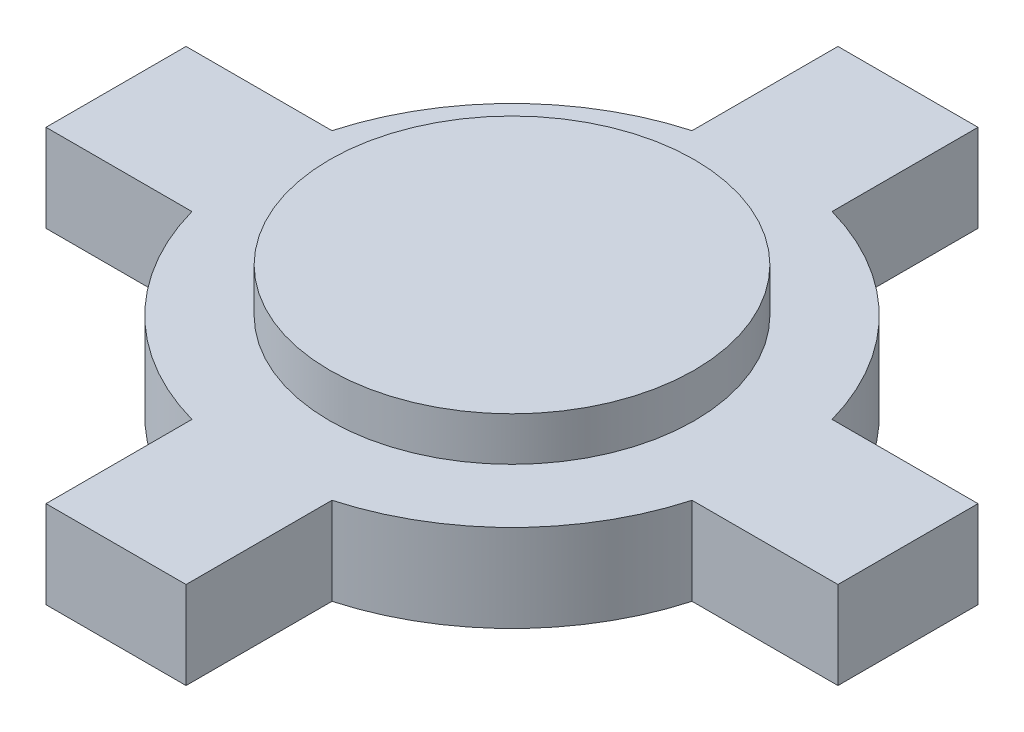
ISO-10303-21;
HEADER;
FILE_DESCRIPTION(('STEP AP214'),'2;1');
FILE_NAME('part.step','',(''),(''),'','','');
FILE_SCHEMA(('AUTOMOTIVE_DESIGN { 1 0 10303 214 1 1 1 1 }'));
ENDSEC;
DATA;
#1=APPLICATION_CONTEXT('core data for automotive mechanical design processes');
#2=APPLICATION_PROTOCOL_DEFINITION('international standard','automotive_design',2000,#1);
#3=PRODUCT_CONTEXT('',#1,'mechanical');
#4=PRODUCT('Part','Part','',(#3));
#5=PRODUCT_RELATED_PRODUCT_CATEGORY('part','',(#4));
#6=PRODUCT_DEFINITION_FORMATION('','',#4);
#7=PRODUCT_DEFINITION_CONTEXT('part definition',#1,'design');
#8=PRODUCT_DEFINITION('design','',#6,#7);
#9=PRODUCT_DEFINITION_SHAPE('','',#8);
#10=(LENGTH_UNIT() NAMED_UNIT(*) SI_UNIT(.MILLI.,.METRE.));
#11=(NAMED_UNIT(*) PLANE_ANGLE_UNIT() SI_UNIT($,.RADIAN.));
#12=(NAMED_UNIT(*) SI_UNIT($,.STERADIAN.) SOLID_ANGLE_UNIT());
#13=UNCERTAINTY_MEASURE_WITH_UNIT(LENGTH_MEASURE(1.E-05),#10,'distance_accuracy_value','');
#14=(GEOMETRIC_REPRESENTATION_CONTEXT(3) GLOBAL_UNCERTAINTY_ASSIGNED_CONTEXT((#13)) GLOBAL_UNIT_ASSIGNED_CONTEXT((#10,
#11,#12)) REPRESENTATION_CONTEXT('',''));
#15=CARTESIAN_POINT('',(0.,0.,0.));
#16=DIRECTION('',(0.,0.,1.));
#17=DIRECTION('',(1.,0.,0.));
#18=AXIS2_PLACEMENT_3D('',#15,#16,#17);
#19=CARTESIAN_POINT('',(-13.5702975444263,3.,-2.4));
#20=DIRECTION('',(1.,0.,0.));
#21=DIRECTION('',(0.,0.,-1.));
#22=AXIS2_PLACEMENT_3D('',#19,#20,#21);
#23=PLANE('',#22);
#24=DIRECTION('',(0.,0.,1.));
#25=VECTOR('',#24,1.);
#26=CARTESIAN_POINT('',(-13.5702975444263,0.,-2.4));
#27=LINE('',#26,#25);
#28=CARTESIAN_POINT('',(-13.5702975444263,0.,-2.4));
#29=VERTEX_POINT('',#28);
#30=CARTESIAN_POINT('',(-13.5702975444263,0.,2.4));
#31=VERTEX_POINT('',#30);
#32=EDGE_CURVE('E187',#29,#31,#27,.T.);
#33=ORIENTED_EDGE('',*,*,#32,.T.);
#34=DIRECTION('',(0.,-1.,0.));
#35=VECTOR('',#34,1.);
#36=CARTESIAN_POINT('',(-13.5702975444263,3.,2.4));
#37=LINE('',#36,#35);
#38=CARTESIAN_POINT('',(-13.5702975444263,3.,2.4));
#39=VERTEX_POINT('',#38);
#40=EDGE_CURVE('E44',#39,#31,#37,.T.);
#41=ORIENTED_EDGE('',*,*,#40,.F.);
#42=DIRECTION('',(0.,0.,1.));
#43=VECTOR('',#42,1.);
#44=CARTESIAN_POINT('',(-13.5702975444263,3.,-2.4));
#45=LINE('',#44,#43);
#46=CARTESIAN_POINT('',(-13.5702975444263,3.,-2.4));
#47=VERTEX_POINT('',#46);
#48=EDGE_CURVE('E218',#47,#39,#45,.T.);
#49=ORIENTED_EDGE('',*,*,#48,.F.);
#50=DIRECTION('',(0.,-1.,0.));
#51=VECTOR('',#50,1.);
#52=CARTESIAN_POINT('',(-13.5702975444263,3.,-2.4));
#53=LINE('',#52,#51);
#54=EDGE_CURVE('E183',#47,#29,#53,.T.);
#55=ORIENTED_EDGE('',*,*,#54,.T.);
#56=EDGE_LOOP('',(#33,#41,#49,#55));
#57=FACE_BOUND('',#56,.T.);
#58=ADVANCED_FACE('F41',(#57),#23,.F.);
#59=CARTESIAN_POINT('',(-13.5702975444263,3.,2.4));
#60=DIRECTION('',(0.,0.,-1.));
#61=DIRECTION('',(-1.,0.,0.));
#62=AXIS2_PLACEMENT_3D('',#59,#60,#61);
#63=PLANE('',#62);
#64=DIRECTION('',(1.,0.,0.));
#65=VECTOR('',#64,1.);
#66=CARTESIAN_POINT('',(-13.5702975444263,0.,2.4));
#67=LINE('',#66,#65);
#68=CARTESIAN_POINT('',(-8.57029754442633,0.,2.4));
#69=VERTEX_POINT('',#68);
#70=EDGE_CURVE('E190',#31,#69,#67,.T.);
#71=ORIENTED_EDGE('',*,*,#70,.T.);
#72=DIRECTION('',(0.,-1.,0.));
#73=VECTOR('',#72,1.);
#74=CARTESIAN_POINT('',(-8.57029754442633,3.,2.4));
#75=LINE('',#74,#73);
#76=CARTESIAN_POINT('',(-8.57029754442633,3.,2.4));
#77=VERTEX_POINT('',#76);
#78=EDGE_CURVE('E251',#77,#69,#75,.T.);
#79=ORIENTED_EDGE('',*,*,#78,.F.);
#80=DIRECTION('',(1.,0.,0.));
#81=VECTOR('',#80,1.);
#82=CARTESIAN_POINT('',(-13.5702975444263,3.,2.4));
#83=LINE('',#82,#81);
#84=EDGE_CURVE('E126',#39,#77,#83,.T.);
#85=ORIENTED_EDGE('',*,*,#84,.F.);
#86=ORIENTED_EDGE('',*,*,#40,.T.);
#87=EDGE_LOOP('',(#71,#79,#85,#86));
#88=FACE_BOUND('',#87,.T.);
#89=ADVANCED_FACE('F257',(#88),#63,.F.);
#90=CARTESIAN_POINT('',(0.,3.,0.));
#91=DIRECTION('',(0.,-1.,0.));
#92=DIRECTION('',(0.,0.,-1.));
#93=AXIS2_PLACEMENT_3D('',#90,#91,#92);
#94=CYLINDRICAL_SURFACE('',#93,8.9);
#95=CARTESIAN_POINT('',(0.,0.,0.));
#96=DIRECTION('',(0.,1.,0.));
#97=DIRECTION('',(0.,0.,1.));
#98=AXIS2_PLACEMENT_3D('',#95,#96,#97);
#99=CIRCLE('',#98,8.9);
#100=CARTESIAN_POINT('',(-2.39999999999999,0.,8.57029754442633));
#101=VERTEX_POINT('',#100);
#102=EDGE_CURVE('E193',#69,#101,#99,.T.);
#103=ORIENTED_EDGE('',*,*,#102,.T.);
#104=DIRECTION('',(0.,-1.,0.));
#105=VECTOR('',#104,1.);
#106=CARTESIAN_POINT('',(-2.39999999999999,3.,8.57029754442633));
#107=LINE('',#106,#105);
#108=CARTESIAN_POINT('',(-2.39999999999999,3.,8.57029754442633));
#109=VERTEX_POINT('',#108);
#110=EDGE_CURVE('E249',#109,#101,#107,.T.);
#111=ORIENTED_EDGE('',*,*,#110,.F.);
#112=CARTESIAN_POINT('',(0.,3.,0.));
#113=DIRECTION('',(0.,1.,0.));
#114=DIRECTION('',(0.,0.,1.));
#115=AXIS2_PLACEMENT_3D('',#112,#113,#114);
#116=CIRCLE('',#115,8.9);
#117=EDGE_CURVE('E274',#77,#109,#116,.T.);
#118=ORIENTED_EDGE('',*,*,#117,.F.);
#119=ORIENTED_EDGE('',*,*,#78,.T.);
#120=EDGE_LOOP('',(#103,#111,#118,#119));
#121=FACE_BOUND('',#120,.T.);
#122=ADVANCED_FACE('F266',(#121),#94,.T.);
#123=CARTESIAN_POINT('',(-2.39999999999999,3.,8.57029754442633));
#124=DIRECTION('',(1.,0.,0.));
#125=DIRECTION('',(0.,0.,-1.));
#126=AXIS2_PLACEMENT_3D('',#123,#124,#125);
#127=PLANE('',#126);
#128=DIRECTION('',(0.,0.,1.));
#129=VECTOR('',#128,1.);
#130=CARTESIAN_POINT('',(-2.39999999999999,0.,8.57029754442633));
#131=LINE('',#130,#129);
#132=CARTESIAN_POINT('',(-2.4,0.,13.5702975444263));
#133=VERTEX_POINT('',#132);
#134=EDGE_CURVE('E195',#101,#133,#131,.T.);
#135=ORIENTED_EDGE('',*,*,#134,.T.);
#136=DIRECTION('',(0.,-1.,0.));
#137=VECTOR('',#136,1.);
#138=CARTESIAN_POINT('',(-2.4,3.,13.5702975444263));
#139=LINE('',#138,#137);
#140=CARTESIAN_POINT('',(-2.4,3.,13.5702975444263));
#141=VERTEX_POINT('',#140);
#142=EDGE_CURVE('E246',#141,#133,#139,.T.);
#143=ORIENTED_EDGE('',*,*,#142,.F.);
#144=DIRECTION('',(0.,0.,1.));
#145=VECTOR('',#144,1.);
#146=CARTESIAN_POINT('',(-2.39999999999999,3.,8.57029754442633));
#147=LINE('',#146,#145);
#148=EDGE_CURVE('E271',#109,#141,#147,.T.);
#149=ORIENTED_EDGE('',*,*,#148,.F.);
#150=ORIENTED_EDGE('',*,*,#110,.T.);
#151=EDGE_LOOP('',(#135,#143,#149,#150));
#152=FACE_BOUND('',#151,.T.);
#153=ADVANCED_FACE('F269',(#152),#127,.F.);
#154=CARTESIAN_POINT('',(-2.4,3.,13.5702975444263));
#155=DIRECTION('',(0.,0.,-1.));
#156=DIRECTION('',(-1.,0.,0.));
#157=AXIS2_PLACEMENT_3D('',#154,#155,#156);
#158=PLANE('',#157);
#159=DIRECTION('',(1.,0.,0.));
#160=VECTOR('',#159,1.);
#161=CARTESIAN_POINT('',(-2.4,0.,13.5702975444263));
#162=LINE('',#161,#160);
#163=CARTESIAN_POINT('',(2.4,0.,13.5702975444263));
#164=VERTEX_POINT('',#163);
#165=EDGE_CURVE('E197',#133,#164,#162,.T.);
#166=ORIENTED_EDGE('',*,*,#165,.T.);
#167=DIRECTION('',(0.,-1.,0.));
#168=VECTOR('',#167,1.);
#169=CARTESIAN_POINT('',(2.4,3.,13.5702975444263));
#170=LINE('',#169,#168);
#171=CARTESIAN_POINT('',(2.4,3.,13.5702975444263));
#172=VERTEX_POINT('',#171);
#173=EDGE_CURVE('E243',#172,#164,#170,.T.);
#174=ORIENTED_EDGE('',*,*,#173,.F.);
#175=DIRECTION('',(1.,0.,0.));
#176=VECTOR('',#175,1.);
#177=CARTESIAN_POINT('',(-2.4,3.,13.5702975444263));
#178=LINE('',#177,#176);
#179=EDGE_CURVE('E273',#141,#172,#178,.T.);
#180=ORIENTED_EDGE('',*,*,#179,.F.);
#181=ORIENTED_EDGE('',*,*,#142,.T.);
#182=EDGE_LOOP('',(#166,#174,#180,#181));
#183=FACE_BOUND('',#182,.T.);
#184=ADVANCED_FACE('F333',(#183),#158,.F.);
#185=CARTESIAN_POINT('',(2.39999999999999,3.,8.57029754442633));
#186=DIRECTION('',(-1.,0.,0.));
#187=DIRECTION('',(0.,0.,1.));
#188=AXIS2_PLACEMENT_3D('',#185,#186,#187);
#189=PLANE('',#188);
#190=DIRECTION('',(0.,0.,-1.));
#191=VECTOR('',#190,1.);
#192=CARTESIAN_POINT('',(2.39999999999999,0.,8.57029754442633));
#193=LINE('',#192,#191);
#194=CARTESIAN_POINT('',(2.39999999999999,0.,8.57029754442633));
#195=VERTEX_POINT('',#194);
#196=EDGE_CURVE('E199',#164,#195,#193,.T.);
#197=ORIENTED_EDGE('',*,*,#196,.T.);
#198=DIRECTION('',(0.,-1.,0.));
#199=VECTOR('',#198,1.);
#200=CARTESIAN_POINT('',(2.39999999999999,3.,8.57029754442633));
#201=LINE('',#200,#199);
#202=CARTESIAN_POINT('',(2.39999999999999,3.,8.57029754442633));
#203=VERTEX_POINT('',#202);
#204=EDGE_CURVE('E240',#203,#195,#201,.T.);
#205=ORIENTED_EDGE('',*,*,#204,.F.);
#206=DIRECTION('',(0.,0.,-1.));
#207=VECTOR('',#206,1.);
#208=CARTESIAN_POINT('',(2.39999999999999,3.,8.57029754442633));
#209=LINE('',#208,#207);
#210=EDGE_CURVE('E276',#172,#203,#209,.T.);
#211=ORIENTED_EDGE('',*,*,#210,.F.);
#212=ORIENTED_EDGE('',*,*,#173,.T.);
#213=EDGE_LOOP('',(#197,#205,#211,#212));
#214=FACE_BOUND('',#213,.T.);
#215=ADVANCED_FACE('F330',(#214),#189,.F.);
#216=CARTESIAN_POINT('',(0.,3.,0.));
#217=DIRECTION('',(0.,-1.,0.));
#218=DIRECTION('',(0.,0.,-1.));
#219=AXIS2_PLACEMENT_3D('',#216,#217,#218);
#220=CYLINDRICAL_SURFACE('',#219,8.9);
#221=CARTESIAN_POINT('',(0.,0.,0.));
#222=DIRECTION('',(0.,1.,0.));
#223=DIRECTION('',(0.,0.,1.));
#224=AXIS2_PLACEMENT_3D('',#221,#222,#223);
#225=CIRCLE('',#224,8.9);
#226=CARTESIAN_POINT('',(8.57029754442633,0.,2.4));
#227=VERTEX_POINT('',#226);
#228=EDGE_CURVE('E201',#195,#227,#225,.T.);
#229=ORIENTED_EDGE('',*,*,#228,.T.);
#230=DIRECTION('',(0.,-1.,0.));
#231=VECTOR('',#230,1.);
#232=CARTESIAN_POINT('',(8.57029754442633,3.,2.4));
#233=LINE('',#232,#231);
#234=CARTESIAN_POINT('',(8.57029754442633,3.,2.4));
#235=VERTEX_POINT('',#234);
#236=EDGE_CURVE('E237',#235,#227,#233,.T.);
#237=ORIENTED_EDGE('',*,*,#236,.F.);
#238=CARTESIAN_POINT('',(0.,3.,0.));
#239=DIRECTION('',(0.,1.,0.));
#240=DIRECTION('',(0.,0.,1.));
#241=AXIS2_PLACEMENT_3D('',#238,#239,#240);
#242=CIRCLE('',#241,8.9);
#243=EDGE_CURVE('E282',#203,#235,#242,.T.);
#244=ORIENTED_EDGE('',*,*,#243,.F.);
#245=ORIENTED_EDGE('',*,*,#204,.T.);
#246=EDGE_LOOP('',(#229,#237,#244,#245));
#247=FACE_BOUND('',#246,.T.);
#248=ADVANCED_FACE('F326',(#247),#220,.T.);
#249=CARTESIAN_POINT('',(8.57029754442633,3.,2.4));
#250=DIRECTION('',(0.,0.,-1.));
#251=DIRECTION('',(-1.,0.,0.));
#252=AXIS2_PLACEMENT_3D('',#249,#250,#251);
#253=PLANE('',#252);
#254=DIRECTION('',(1.,0.,0.));
#255=VECTOR('',#254,1.);
#256=CARTESIAN_POINT('',(8.57029754442633,0.,2.4));
#257=LINE('',#256,#255);
#258=CARTESIAN_POINT('',(13.5702975444263,0.,2.4));
#259=VERTEX_POINT('',#258);
#260=EDGE_CURVE('E203',#227,#259,#257,.T.);
#261=ORIENTED_EDGE('',*,*,#260,.T.);
#262=DIRECTION('',(0.,-1.,0.));
#263=VECTOR('',#262,1.);
#264=CARTESIAN_POINT('',(13.5702975444263,3.,2.4));
#265=LINE('',#264,#263);
#266=CARTESIAN_POINT('',(13.5702975444263,3.,2.4));
#267=VERTEX_POINT('',#266);
#268=EDGE_CURVE('E234',#267,#259,#265,.T.);
#269=ORIENTED_EDGE('',*,*,#268,.F.);
#270=DIRECTION('',(1.,0.,0.));
#271=VECTOR('',#270,1.);
#272=CARTESIAN_POINT('',(8.57029754442633,3.,2.4));
#273=LINE('',#272,#271);
#274=EDGE_CURVE('E284',#235,#267,#273,.T.);
#275=ORIENTED_EDGE('',*,*,#274,.F.);
#276=ORIENTED_EDGE('',*,*,#236,.T.);
#277=EDGE_LOOP('',(#261,#269,#275,#276));
#278=FACE_BOUND('',#277,.T.);
#279=ADVANCED_FACE('F321',(#278),#253,.F.);
#280=CARTESIAN_POINT('',(13.5702975444263,3.,-2.4));
#281=DIRECTION('',(-1.,0.,0.));
#282=DIRECTION('',(0.,0.,1.));
#283=AXIS2_PLACEMENT_3D('',#280,#281,#282);
#284=PLANE('',#283);
#285=DIRECTION('',(0.,0.,-1.));
#286=VECTOR('',#285,1.);
#287=CARTESIAN_POINT('',(13.5702975444263,0.,-2.4));
#288=LINE('',#287,#286);
#289=CARTESIAN_POINT('',(13.5702975444263,0.,-2.4));
#290=VERTEX_POINT('',#289);
#291=EDGE_CURVE('E205',#259,#290,#288,.T.);
#292=ORIENTED_EDGE('',*,*,#291,.T.);
#293=DIRECTION('',(0.,-1.,0.));
#294=VECTOR('',#293,1.);
#295=CARTESIAN_POINT('',(13.5702975444263,3.,-2.4));
#296=LINE('',#295,#294);
#297=CARTESIAN_POINT('',(13.5702975444263,3.,-2.4));
#298=VERTEX_POINT('',#297);
#299=EDGE_CURVE('E231',#298,#290,#296,.T.);
#300=ORIENTED_EDGE('',*,*,#299,.F.);
#301=DIRECTION('',(0.,0.,-1.));
#302=VECTOR('',#301,1.);
#303=CARTESIAN_POINT('',(13.5702975444263,3.,-2.4));
#304=LINE('',#303,#302);
#305=EDGE_CURVE('E286',#267,#298,#304,.T.);
#306=ORIENTED_EDGE('',*,*,#305,.F.);
#307=ORIENTED_EDGE('',*,*,#268,.T.);
#308=EDGE_LOOP('',(#292,#300,#306,#307));
#309=FACE_BOUND('',#308,.T.);
#310=ADVANCED_FACE('F315',(#309),#284,.F.);
#311=CARTESIAN_POINT('',(8.57029754442633,3.,-2.4));
#312=DIRECTION('',(0.,0.,1.));
#313=DIRECTION('',(1.,0.,0.));
#314=AXIS2_PLACEMENT_3D('',#311,#312,#313);
#315=PLANE('',#314);
#316=DIRECTION('',(-1.,0.,0.));
#317=VECTOR('',#316,1.);
#318=CARTESIAN_POINT('',(8.57029754442633,0.,-2.4));
#319=LINE('',#318,#317);
#320=CARTESIAN_POINT('',(8.57029754442633,0.,-2.4));
#321=VERTEX_POINT('',#320);
#322=EDGE_CURVE('E207',#290,#321,#319,.T.);
#323=ORIENTED_EDGE('',*,*,#322,.T.);
#324=DIRECTION('',(0.,-1.,0.));
#325=VECTOR('',#324,1.);
#326=CARTESIAN_POINT('',(8.57029754442633,3.,-2.4));
#327=LINE('',#326,#325);
#328=CARTESIAN_POINT('',(8.57029754442633,3.,-2.4));
#329=VERTEX_POINT('',#328);
#330=EDGE_CURVE('E228',#329,#321,#327,.T.);
#331=ORIENTED_EDGE('',*,*,#330,.F.);
#332=DIRECTION('',(-1.,0.,0.));
#333=VECTOR('',#332,1.);
#334=CARTESIAN_POINT('',(8.57029754442633,3.,-2.4));
#335=LINE('',#334,#333);
#336=EDGE_CURVE('E288',#298,#329,#335,.T.);
#337=ORIENTED_EDGE('',*,*,#336,.F.);
#338=ORIENTED_EDGE('',*,*,#299,.T.);
#339=EDGE_LOOP('',(#323,#331,#337,#338));
#340=FACE_BOUND('',#339,.T.);
#341=ADVANCED_FACE('F311',(#340),#315,.F.);
#342=CARTESIAN_POINT('',(0.,3.,0.));
#343=DIRECTION('',(0.,-1.,0.));
#344=DIRECTION('',(0.,0.,-1.));
#345=AXIS2_PLACEMENT_3D('',#342,#343,#344);
#346=CYLINDRICAL_SURFACE('',#345,8.9);
#347=CARTESIAN_POINT('',(0.,0.,0.));
#348=DIRECTION('',(0.,1.,0.));
#349=DIRECTION('',(0.,0.,1.));
#350=AXIS2_PLACEMENT_3D('',#347,#348,#349);
#351=CIRCLE('',#350,8.9);
#352=CARTESIAN_POINT('',(2.4,0.,-8.57029754442633));
#353=VERTEX_POINT('',#352);
#354=EDGE_CURVE('E209',#321,#353,#351,.T.);
#355=ORIENTED_EDGE('',*,*,#354,.T.);
#356=DIRECTION('',(0.,-1.,0.));
#357=VECTOR('',#356,1.);
#358=CARTESIAN_POINT('',(2.4,3.,-8.57029754442633));
#359=LINE('',#358,#357);
#360=CARTESIAN_POINT('',(2.4,3.,-8.57029754442633));
#361=VERTEX_POINT('',#360);
#362=EDGE_CURVE('E225',#361,#353,#359,.T.);
#363=ORIENTED_EDGE('',*,*,#362,.F.);
#364=CARTESIAN_POINT('',(0.,3.,0.));
#365=DIRECTION('',(0.,1.,0.));
#366=DIRECTION('',(0.,0.,1.));
#367=AXIS2_PLACEMENT_3D('',#364,#365,#366);
#368=CIRCLE('',#367,8.9);
#369=EDGE_CURVE('E290',#329,#361,#368,.T.);
#370=ORIENTED_EDGE('',*,*,#369,.F.);
#371=ORIENTED_EDGE('',*,*,#330,.T.);
#372=EDGE_LOOP('',(#355,#363,#370,#371));
#373=FACE_BOUND('',#372,.T.);
#374=ADVANCED_FACE('F307',(#373),#346,.T.);
#375=CARTESIAN_POINT('',(2.4,3.,-13.5702975444263));
#376=DIRECTION('',(-1.,0.,0.));
#377=DIRECTION('',(0.,0.,1.));
#378=AXIS2_PLACEMENT_3D('',#375,#376,#377);
#379=PLANE('',#378);
#380=DIRECTION('',(0.,0.,-1.));
#381=VECTOR('',#380,1.);
#382=CARTESIAN_POINT('',(2.4,0.,-13.5702975444263));
#383=LINE('',#382,#381);
#384=CARTESIAN_POINT('',(2.4,0.,-13.5702975444263));
#385=VERTEX_POINT('',#384);
#386=EDGE_CURVE('E211',#353,#385,#383,.T.);
#387=ORIENTED_EDGE('',*,*,#386,.T.);
#388=DIRECTION('',(0.,-1.,0.));
#389=VECTOR('',#388,1.);
#390=CARTESIAN_POINT('',(2.4,3.,-13.5702975444263));
#391=LINE('',#390,#389);
#392=CARTESIAN_POINT('',(2.4,3.,-13.5702975444263));
#393=VERTEX_POINT('',#392);
#394=EDGE_CURVE('E222',#393,#385,#391,.T.);
#395=ORIENTED_EDGE('',*,*,#394,.F.);
#396=DIRECTION('',(0.,0.,-1.));
#397=VECTOR('',#396,1.);
#398=CARTESIAN_POINT('',(2.4,3.,-13.5702975444263));
#399=LINE('',#398,#397);
#400=EDGE_CURVE('E292',#361,#393,#399,.T.);
#401=ORIENTED_EDGE('',*,*,#400,.F.);
#402=ORIENTED_EDGE('',*,*,#362,.T.);
#403=EDGE_LOOP('',(#387,#395,#401,#402));
#404=FACE_BOUND('',#403,.T.);
#405=ADVANCED_FACE('F298',(#404),#379,.F.);
#406=CARTESIAN_POINT('',(-2.4,3.,-13.5702975444263));
#407=DIRECTION('',(0.,0.,1.));
#408=DIRECTION('',(1.,0.,0.));
#409=AXIS2_PLACEMENT_3D('',#406,#407,#408);
#410=PLANE('',#409);
#411=DIRECTION('',(-1.,0.,0.));
#412=VECTOR('',#411,1.);
#413=CARTESIAN_POINT('',(-2.4,0.,-13.5702975444263));
#414=LINE('',#413,#412);
#415=CARTESIAN_POINT('',(-2.4,0.,-13.5702975444263));
#416=VERTEX_POINT('',#415);
#417=EDGE_CURVE('E213',#385,#416,#414,.T.);
#418=ORIENTED_EDGE('',*,*,#417,.T.);
#419=DIRECTION('',(0.,-1.,0.));
#420=VECTOR('',#419,1.);
#421=CARTESIAN_POINT('',(-2.4,3.,-13.5702975444263));
#422=LINE('',#421,#420);
#423=CARTESIAN_POINT('',(-2.4,3.,-13.5702975444263));
#424=VERTEX_POINT('',#423);
#425=EDGE_CURVE('E178',#424,#416,#422,.T.);
#426=ORIENTED_EDGE('',*,*,#425,.F.);
#427=DIRECTION('',(-1.,0.,0.));
#428=VECTOR('',#427,1.);
#429=CARTESIAN_POINT('',(-2.4,3.,-13.5702975444263));
#430=LINE('',#429,#428);
#431=EDGE_CURVE('E169',#393,#424,#430,.T.);
#432=ORIENTED_EDGE('',*,*,#431,.F.);
#433=ORIENTED_EDGE('',*,*,#394,.T.);
#434=EDGE_LOOP('',(#418,#426,#432,#433));
#435=FACE_BOUND('',#434,.T.);
#436=ADVANCED_FACE('F302',(#435),#410,.F.);
#437=CARTESIAN_POINT('',(-2.4,3.,-13.5702975444263));
#438=DIRECTION('',(1.,0.,0.));
#439=DIRECTION('',(0.,0.,-1.));
#440=AXIS2_PLACEMENT_3D('',#437,#438,#439);
#441=PLANE('',#440);
#442=DIRECTION('',(0.,0.,1.));
#443=VECTOR('',#442,1.);
#444=CARTESIAN_POINT('',(-2.4,0.,-13.5702975444263));
#445=LINE('',#444,#443);
#446=CARTESIAN_POINT('',(-2.4,0.,-8.57029754442633));
#447=VERTEX_POINT('',#446);
#448=EDGE_CURVE('E177',#416,#447,#445,.T.);
#449=ORIENTED_EDGE('',*,*,#448,.T.);
#450=DIRECTION('',(0.,-1.,0.));
#451=VECTOR('',#450,1.);
#452=CARTESIAN_POINT('',(-2.4,3.,-8.57029754442633));
#453=LINE('',#452,#451);
#454=CARTESIAN_POINT('',(-2.4,3.,-8.57029754442633));
#455=VERTEX_POINT('',#454);
#456=EDGE_CURVE('E174',#455,#447,#453,.T.);
#457=ORIENTED_EDGE('',*,*,#456,.F.);
#458=DIRECTION('',(0.,0.,1.));
#459=VECTOR('',#458,1.);
#460=CARTESIAN_POINT('',(-2.4,3.,-13.5702975444263));
#461=LINE('',#460,#459);
#462=EDGE_CURVE('E163',#424,#455,#461,.T.);
#463=ORIENTED_EDGE('',*,*,#462,.F.);
#464=ORIENTED_EDGE('',*,*,#425,.T.);
#465=EDGE_LOOP('',(#449,#457,#463,#464));
#466=FACE_BOUND('',#465,.T.);
#467=ADVANCED_FACE('F175',(#466),#441,.F.);
#468=CARTESIAN_POINT('',(0.,3.,0.));
#469=DIRECTION('',(0.,-1.,0.));
#470=DIRECTION('',(0.,0.,-1.));
#471=AXIS2_PLACEMENT_3D('',#468,#469,#470);
#472=CYLINDRICAL_SURFACE('',#471,8.9);
#473=CARTESIAN_POINT('',(0.,0.,0.));
#474=DIRECTION('',(0.,1.,0.));
#475=DIRECTION('',(0.,0.,1.));
#476=AXIS2_PLACEMENT_3D('',#473,#474,#475);
#477=CIRCLE('',#476,8.9);
#478=CARTESIAN_POINT('',(-8.57029754442633,0.,-2.4));
#479=VERTEX_POINT('',#478);
#480=EDGE_CURVE('E111',#447,#479,#477,.T.);
#481=ORIENTED_EDGE('',*,*,#480,.T.);
#482=DIRECTION('',(0.,-1.,0.));
#483=VECTOR('',#482,1.);
#484=CARTESIAN_POINT('',(-8.57029754442633,3.,-2.4));
#485=LINE('',#484,#483);
#486=CARTESIAN_POINT('',(-8.57029754442633,3.,-2.4));
#487=VERTEX_POINT('',#486);
#488=EDGE_CURVE('E179',#487,#479,#485,.T.);
#489=ORIENTED_EDGE('',*,*,#488,.F.);
#490=CARTESIAN_POINT('',(0.,3.,0.));
#491=DIRECTION('',(0.,1.,0.));
#492=DIRECTION('',(0.,0.,1.));
#493=AXIS2_PLACEMENT_3D('',#490,#491,#492);
#494=CIRCLE('',#493,8.9);
#495=EDGE_CURVE('E167',#455,#487,#494,.T.);
#496=ORIENTED_EDGE('',*,*,#495,.F.);
#497=ORIENTED_EDGE('',*,*,#456,.T.);
#498=EDGE_LOOP('',(#481,#489,#496,#497));
#499=FACE_BOUND('',#498,.T.);
#500=ADVANCED_FACE('F181',(#499),#472,.T.);
#501=CARTESIAN_POINT('',(-13.5702975444263,3.,-2.4));
#502=DIRECTION('',(0.,0.,1.));
#503=DIRECTION('',(1.,0.,0.));
#504=AXIS2_PLACEMENT_3D('',#501,#502,#503);
#505=PLANE('',#504);
#506=DIRECTION('',(-1.,0.,0.));
#507=VECTOR('',#506,1.);
#508=CARTESIAN_POINT('',(-13.5702975444263,0.,-2.4));
#509=LINE('',#508,#507);
#510=EDGE_CURVE('E117',#479,#29,#509,.T.);
#511=ORIENTED_EDGE('',*,*,#510,.T.);
#512=ORIENTED_EDGE('',*,*,#54,.F.);
#513=DIRECTION('',(-1.,0.,0.));
#514=VECTOR('',#513,1.);
#515=CARTESIAN_POINT('',(-13.5702975444263,3.,-2.4));
#516=LINE('',#515,#514);
#517=EDGE_CURVE('E58',#487,#47,#516,.T.);
#518=ORIENTED_EDGE('',*,*,#517,.F.);
#519=ORIENTED_EDGE('',*,*,#488,.T.);
#520=EDGE_LOOP('',(#511,#512,#518,#519));
#521=FACE_BOUND('',#520,.T.);
#522=ADVANCED_FACE('F441',(#521),#505,.F.);
#523=CARTESIAN_POINT('',(0.,3.,0.));
#524=DIRECTION('',(0.,1.,0.));
#525=DIRECTION('',(0.,0.,1.));
#526=AXIS2_PLACEMENT_3D('',#523,#524,#525);
#527=PLANE('',#526);
#528=CARTESIAN_POINT('',(0.,3.,0.));
#529=DIRECTION('',(0.,1.,0.));
#530=DIRECTION('',(0.,0.,1.));
#531=AXIS2_PLACEMENT_3D('',#528,#529,#530);
#532=CIRCLE('',#531,6.25);
#533=CARTESIAN_POINT('',(0.,3.,6.25));
#534=VERTEX_POINT('',#533);
#535=EDGE_CURVE('E11',#534,#534,#532,.T.);
#536=ORIENTED_EDGE('',*,*,#535,.F.);
#537=EDGE_LOOP('',(#536));
#538=FACE_BOUND('',#537,.T.);
#539=ORIENTED_EDGE('',*,*,#48,.T.);
#540=ORIENTED_EDGE('',*,*,#84,.T.);
#541=ORIENTED_EDGE('',*,*,#117,.T.);
#542=ORIENTED_EDGE('',*,*,#148,.T.);
#543=ORIENTED_EDGE('',*,*,#179,.T.);
#544=ORIENTED_EDGE('',*,*,#210,.T.);
#545=ORIENTED_EDGE('',*,*,#243,.T.);
#546=ORIENTED_EDGE('',*,*,#274,.T.);
#547=ORIENTED_EDGE('',*,*,#305,.T.);
#548=ORIENTED_EDGE('',*,*,#336,.T.);
#549=ORIENTED_EDGE('',*,*,#369,.T.);
#550=ORIENTED_EDGE('',*,*,#400,.T.);
#551=ORIENTED_EDGE('',*,*,#431,.T.);
#552=ORIENTED_EDGE('',*,*,#462,.T.);
#553=ORIENTED_EDGE('',*,*,#495,.T.);
#554=ORIENTED_EDGE('',*,*,#517,.T.);
#555=EDGE_LOOP('',(#539,#540,#541,#542,#543,#544,#545,#546,#547,#548,#549,#550,#551,#552,#553,#554));
#556=FACE_BOUND('',#555,.T.);
#557=ADVANCED_FACE('F165',(#538,#556),#527,.T.);
#558=CARTESIAN_POINT('',(0.,0.,0.));
#559=DIRECTION('',(0.,1.,0.));
#560=DIRECTION('',(0.,0.,1.));
#561=AXIS2_PLACEMENT_3D('',#558,#559,#560);
#562=PLANE('',#561);
#563=ORIENTED_EDGE('',*,*,#32,.F.);
#564=ORIENTED_EDGE('',*,*,#510,.F.);
#565=ORIENTED_EDGE('',*,*,#480,.F.);
#566=ORIENTED_EDGE('',*,*,#448,.F.);
#567=ORIENTED_EDGE('',*,*,#417,.F.);
#568=ORIENTED_EDGE('',*,*,#386,.F.);
#569=ORIENTED_EDGE('',*,*,#354,.F.);
#570=ORIENTED_EDGE('',*,*,#322,.F.);
#571=ORIENTED_EDGE('',*,*,#291,.F.);
#572=ORIENTED_EDGE('',*,*,#260,.F.);
#573=ORIENTED_EDGE('',*,*,#228,.F.);
#574=ORIENTED_EDGE('',*,*,#196,.F.);
#575=ORIENTED_EDGE('',*,*,#165,.F.);
#576=ORIENTED_EDGE('',*,*,#134,.F.);
#577=ORIENTED_EDGE('',*,*,#102,.F.);
#578=ORIENTED_EDGE('',*,*,#70,.F.);
#579=EDGE_LOOP('',(#563,#564,#565,#566,#567,#568,#569,#570,#571,#572,#573,#574,#575,#576,#577,#578));
#580=FACE_BOUND('',#579,.T.);
#581=ADVANCED_FACE('F262',(#580),#562,.F.);
#582=CARTESIAN_POINT('',(0.,4.5,0.));
#583=DIRECTION('',(0.,-1.,0.));
#584=DIRECTION('',(0.,0.,-1.));
#585=AXIS2_PLACEMENT_3D('',#582,#583,#584);
#586=CYLINDRICAL_SURFACE('',#585,6.25);
#587=CARTESIAN_POINT('',(0.,4.5,0.));
#588=DIRECTION('',(0.,1.,0.));
#589=DIRECTION('',(0.,0.,1.));
#590=AXIS2_PLACEMENT_3D('',#587,#588,#589);
#591=CIRCLE('',#590,6.25);
#592=CARTESIAN_POINT('',(0.,4.5,6.25));
#593=VERTEX_POINT('',#592);
#594=EDGE_CURVE('E191',#593,#593,#591,.T.);
#595=ORIENTED_EDGE('',*,*,#594,.F.);
#596=EDGE_LOOP('',(#595));
#597=FACE_BOUND('',#596,.T.);
#598=ORIENTED_EDGE('',*,*,#535,.T.);
#599=EDGE_LOOP('',(#598));
#600=FACE_BOUND('',#599,.T.);
#601=ADVANCED_FACE('F468',(#597,#600),#586,.T.);
#602=CARTESIAN_POINT('',(0.,4.5,0.));
#603=DIRECTION('',(0.,1.,0.));
#604=DIRECTION('',(0.,0.,1.));
#605=AXIS2_PLACEMENT_3D('',#602,#603,#604);
#606=PLANE('',#605);
#607=ORIENTED_EDGE('',*,*,#594,.T.);
#608=EDGE_LOOP('',(#607));
#609=FACE_BOUND('',#608,.T.);
#610=ADVANCED_FACE('F476',(#609),#606,.T.);
#611=CLOSED_SHELL('',(#58,#89,#122,#153,#184,#215,#248,#279,#310,#341,#374,#405,#436,#467,#500,
#522,#557,#581,#601,#610));
#612=MANIFOLD_SOLID_BREP('B2',#611);
#613=ADVANCED_BREP_SHAPE_REPRESENTATION('',(#18,#612),#14);
#614=SHAPE_DEFINITION_REPRESENTATION(#9,#613);
ENDSEC;
END-ISO-10303-21;
